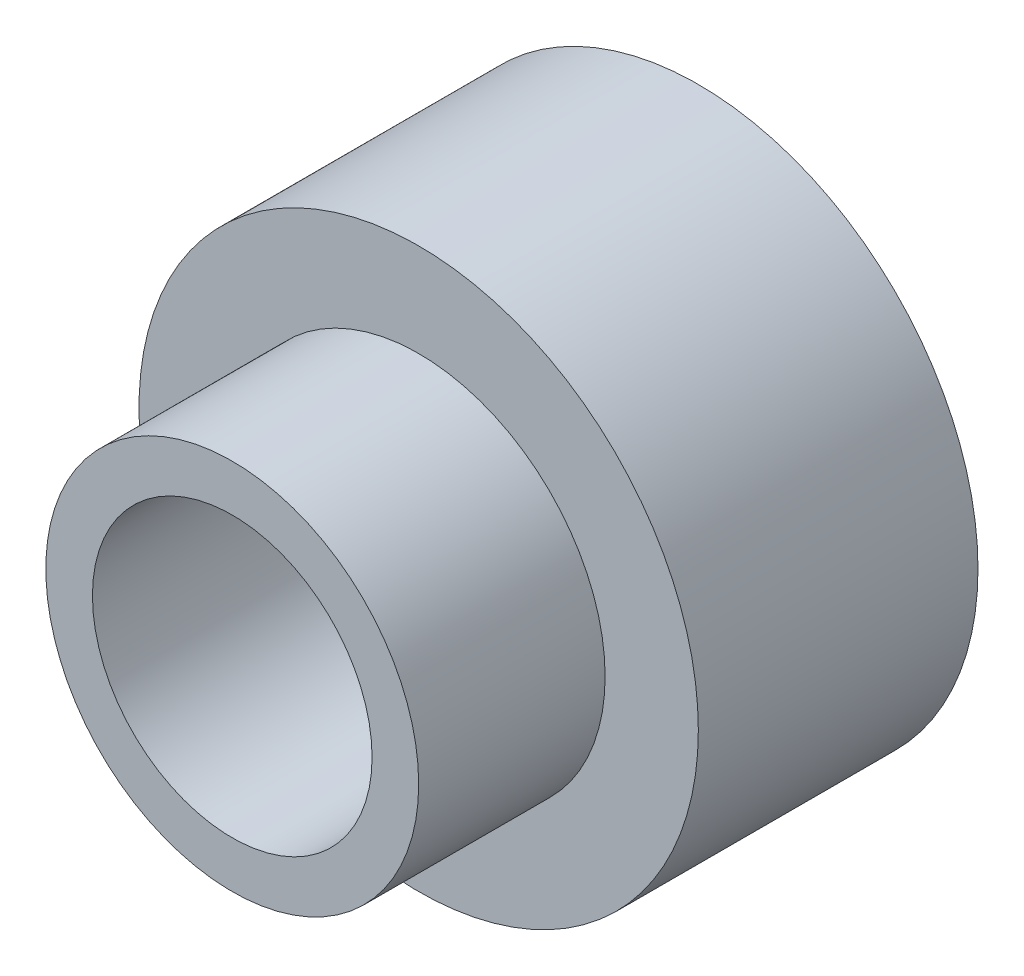
ISO-10303-21;
HEADER;
FILE_DESCRIPTION(('STEP AP214'),'2;1');
FILE_NAME('part.step','',(''),(''),'','','');
FILE_SCHEMA(('AUTOMOTIVE_DESIGN { 1 0 10303 214 1 1 1 1 }'));
ENDSEC;
DATA;
#1=APPLICATION_CONTEXT('core data for automotive mechanical design processes');
#2=APPLICATION_PROTOCOL_DEFINITION('international standard','automotive_design',2000,#1);
#3=PRODUCT_CONTEXT('',#1,'mechanical');
#4=PRODUCT('Part','Part','',(#3));
#5=PRODUCT_RELATED_PRODUCT_CATEGORY('part','',(#4));
#6=PRODUCT_DEFINITION_FORMATION('','',#4);
#7=PRODUCT_DEFINITION_CONTEXT('part definition',#1,'design');
#8=PRODUCT_DEFINITION('design','',#6,#7);
#9=PRODUCT_DEFINITION_SHAPE('','',#8);
#10=(LENGTH_UNIT() NAMED_UNIT(*) SI_UNIT(.MILLI.,.METRE.));
#11=(NAMED_UNIT(*) PLANE_ANGLE_UNIT() SI_UNIT($,.RADIAN.));
#12=(NAMED_UNIT(*) SI_UNIT($,.STERADIAN.) SOLID_ANGLE_UNIT());
#13=UNCERTAINTY_MEASURE_WITH_UNIT(LENGTH_MEASURE(1.E-05),#10,'distance_accuracy_value','');
#14=(GEOMETRIC_REPRESENTATION_CONTEXT(3) GLOBAL_UNCERTAINTY_ASSIGNED_CONTEXT((#13)) GLOBAL_UNIT_ASSIGNED_CONTEXT((#10,
#11,#12)) REPRESENTATION_CONTEXT('',''));
#15=CARTESIAN_POINT('',(0.,0.,0.));
#16=DIRECTION('',(0.,0.,1.));
#17=DIRECTION('',(1.,0.,0.));
#18=AXIS2_PLACEMENT_3D('',#15,#16,#17);
#19=CARTESIAN_POINT('',(0.,0.,3.));
#20=DIRECTION('',(0.,0.,-1.));
#21=DIRECTION('',(-1.,0.,0.));
#22=AXIS2_PLACEMENT_3D('',#19,#20,#21);
#23=CYLINDRICAL_SURFACE('',#22,3.);
#24=CARTESIAN_POINT('',(0.,0.,3.));
#25=DIRECTION('',(0.,0.,1.));
#26=DIRECTION('',(1.,0.,0.));
#27=AXIS2_PLACEMENT_3D('',#24,#25,#26);
#28=CIRCLE('',#27,3.);
#29=CARTESIAN_POINT('',(3.,0.,3.));
#30=VERTEX_POINT('',#29);
#31=EDGE_CURVE('E10',#30,#30,#28,.T.);
#32=ORIENTED_EDGE('',*,*,#31,.F.);
#33=EDGE_LOOP('',(#32));
#34=FACE_BOUND('',#33,.T.);
#35=CARTESIAN_POINT('',(0.,0.,0.));
#36=DIRECTION('',(0.,0.,1.));
#37=DIRECTION('',(1.,0.,0.));
#38=AXIS2_PLACEMENT_3D('',#35,#36,#37);
#39=CIRCLE('',#38,3.);
#40=CARTESIAN_POINT('',(3.,0.,0.));
#41=VERTEX_POINT('',#40);
#42=EDGE_CURVE('E34',#41,#41,#39,.T.);
#43=ORIENTED_EDGE('',*,*,#42,.T.);
#44=EDGE_LOOP('',(#43));
#45=FACE_BOUND('',#44,.T.);
#46=ADVANCED_FACE('F31',(#34,#45),#23,.T.);
#47=CARTESIAN_POINT('',(0.,0.,3.));
#48=DIRECTION('',(0.,0.,1.));
#49=DIRECTION('',(1.,0.,0.));
#50=AXIS2_PLACEMENT_3D('',#47,#48,#49);
#51=PLANE('',#50);
#52=CARTESIAN_POINT('',(0.,0.,3.));
#53=DIRECTION('',(0.,0.,1.));
#54=DIRECTION('',(1.,0.,0.));
#55=AXIS2_PLACEMENT_3D('',#52,#53,#54);
#56=CIRCLE('',#55,2.);
#57=CARTESIAN_POINT('',(2.,0.,3.));
#58=VERTEX_POINT('',#57);
#59=EDGE_CURVE('E41',#58,#58,#56,.F.);
#60=ORIENTED_EDGE('',*,*,#59,.T.);
#61=EDGE_LOOP('',(#60));
#62=FACE_BOUND('',#61,.T.);
#63=ORIENTED_EDGE('',*,*,#31,.T.);
#64=EDGE_LOOP('',(#63));
#65=FACE_BOUND('',#64,.T.);
#66=ADVANCED_FACE('F72',(#62,#65),#51,.T.);
#67=CARTESIAN_POINT('',(0.,0.,0.));
#68=DIRECTION('',(0.,0.,1.));
#69=DIRECTION('',(1.,0.,0.));
#70=AXIS2_PLACEMENT_3D('',#67,#68,#69);
#71=PLANE('',#70);
#72=CARTESIAN_POINT('',(0.,0.,0.));
#73=DIRECTION('',(0.,0.,1.));
#74=DIRECTION('',(1.,0.,0.));
#75=AXIS2_PLACEMENT_3D('',#72,#73,#74);
#76=CIRCLE('',#75,1.5);
#77=CARTESIAN_POINT('',(1.5,0.,0.));
#78=VERTEX_POINT('',#77);
#79=EDGE_CURVE('E49',#78,#78,#76,.T.);
#80=ORIENTED_EDGE('',*,*,#79,.T.);
#81=EDGE_LOOP('',(#80));
#82=FACE_BOUND('',#81,.T.);
#83=ORIENTED_EDGE('',*,*,#42,.F.);
#84=EDGE_LOOP('',(#83));
#85=FACE_BOUND('',#84,.T.);
#86=ADVANCED_FACE('F66',(#82,#85),#71,.F.);
#87=CARTESIAN_POINT('',(0.,0.,5.));
#88=DIRECTION('',(0.,0.,-1.));
#89=DIRECTION('',(-1.,0.,0.));
#90=AXIS2_PLACEMENT_3D('',#87,#88,#89);
#91=CYLINDRICAL_SURFACE('',#90,2.);
#92=ORIENTED_EDGE('',*,*,#59,.F.);
#93=EDGE_LOOP('',(#92));
#94=FACE_BOUND('',#93,.T.);
#95=CARTESIAN_POINT('',(0.,0.,5.));
#96=DIRECTION('',(0.,0.,1.));
#97=DIRECTION('',(1.,0.,0.));
#98=AXIS2_PLACEMENT_3D('',#95,#96,#97);
#99=CIRCLE('',#98,2.);
#100=CARTESIAN_POINT('',(2.,0.,5.));
#101=VERTEX_POINT('',#100);
#102=EDGE_CURVE('E45',#101,#101,#99,.T.);
#103=ORIENTED_EDGE('',*,*,#102,.F.);
#104=EDGE_LOOP('',(#103));
#105=FACE_BOUND('',#104,.T.);
#106=ADVANCED_FACE('F61',(#94,#105),#91,.T.);
#107=CARTESIAN_POINT('',(0.,0.,5.));
#108=DIRECTION('',(0.,0.,1.));
#109=DIRECTION('',(1.,0.,0.));
#110=AXIS2_PLACEMENT_3D('',#107,#108,#109);
#111=PLANE('',#110);
#112=CARTESIAN_POINT('',(0.,0.,5.));
#113=DIRECTION('',(0.,0.,1.));
#114=DIRECTION('',(1.,0.,0.));
#115=AXIS2_PLACEMENT_3D('',#112,#113,#114);
#116=CIRCLE('',#115,1.5);
#117=CARTESIAN_POINT('',(1.5,0.,5.));
#118=VERTEX_POINT('',#117);
#119=EDGE_CURVE('E48',#118,#118,#116,.T.);
#120=ORIENTED_EDGE('',*,*,#119,.F.);
#121=EDGE_LOOP('',(#120));
#122=FACE_BOUND('',#121,.T.);
#123=ORIENTED_EDGE('',*,*,#102,.T.);
#124=EDGE_LOOP('',(#123));
#125=FACE_BOUND('',#124,.T.);
#126=ADVANCED_FACE('F58',(#122,#125),#111,.T.);
#127=CARTESIAN_POINT('',(0.,0.,5.));
#128=DIRECTION('',(0.,0.,-1.));
#129=DIRECTION('',(-1.,0.,0.));
#130=AXIS2_PLACEMENT_3D('',#127,#128,#129);
#131=CYLINDRICAL_SURFACE('',#130,1.5);
#132=ORIENTED_EDGE('',*,*,#119,.T.);
#133=EDGE_LOOP('',(#132));
#134=FACE_BOUND('',#133,.T.);
#135=ORIENTED_EDGE('',*,*,#79,.F.);
#136=EDGE_LOOP('',(#135));
#137=FACE_BOUND('',#136,.T.);
#138=ADVANCED_FACE('F55',(#134,#137),#131,.F.);
#139=CLOSED_SHELL('',(#46,#66,#86,#106,#126,#138));
#140=MANIFOLD_SOLID_BREP('B2',#139);
#141=ADVANCED_BREP_SHAPE_REPRESENTATION('',(#18,#140),#14);
#142=SHAPE_DEFINITION_REPRESENTATION(#9,#141);
ENDSEC;
END-ISO-10303-21;
